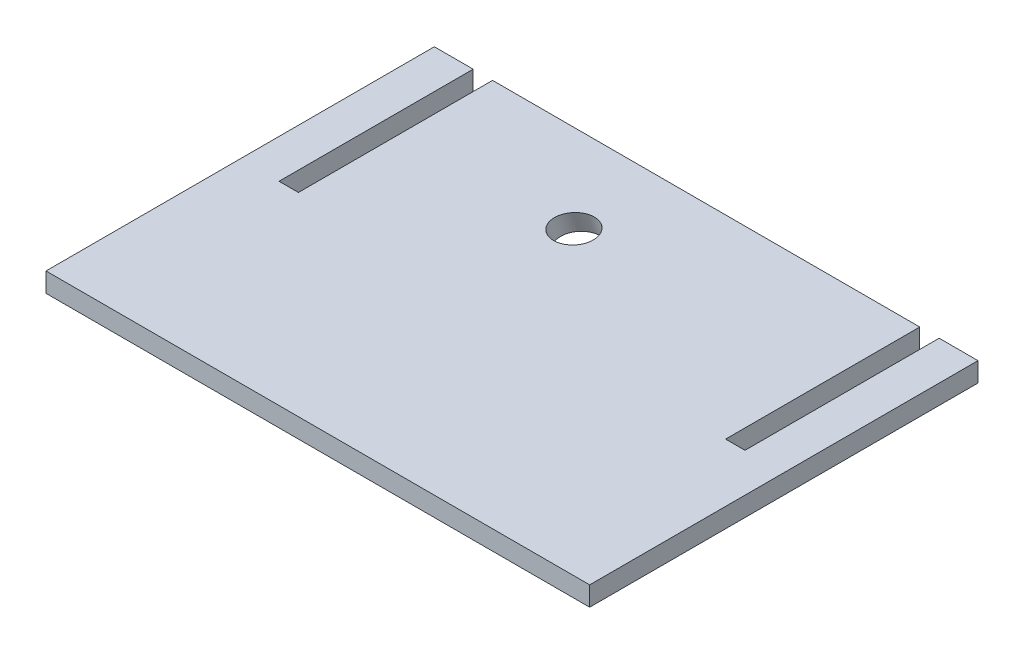
ISO-10303-21;
HEADER;
FILE_DESCRIPTION(('STEP AP214'),'2;1');
FILE_NAME('part.step','',(''),(''),'','','');
FILE_SCHEMA(('AUTOMOTIVE_DESIGN { 1 0 10303 214 1 1 1 1 }'));
ENDSEC;
DATA;
#1=APPLICATION_CONTEXT('core data for automotive mechanical design processes');
#2=APPLICATION_PROTOCOL_DEFINITION('international standard','automotive_design',2000,#1);
#3=PRODUCT_CONTEXT('',#1,'mechanical');
#4=PRODUCT('Part','Part','',(#3));
#5=PRODUCT_RELATED_PRODUCT_CATEGORY('part','',(#4));
#6=PRODUCT_DEFINITION_FORMATION('','',#4);
#7=PRODUCT_DEFINITION_CONTEXT('part definition',#1,'design');
#8=PRODUCT_DEFINITION('design','',#6,#7);
#9=PRODUCT_DEFINITION_SHAPE('','',#8);
#10=(LENGTH_UNIT() NAMED_UNIT(*) SI_UNIT(.MILLI.,.METRE.));
#11=(NAMED_UNIT(*) PLANE_ANGLE_UNIT() SI_UNIT($,.RADIAN.));
#12=(NAMED_UNIT(*) SI_UNIT($,.STERADIAN.) SOLID_ANGLE_UNIT());
#13=UNCERTAINTY_MEASURE_WITH_UNIT(LENGTH_MEASURE(1.E-05),#10,'distance_accuracy_value','');
#14=(GEOMETRIC_REPRESENTATION_CONTEXT(3) GLOBAL_UNCERTAINTY_ASSIGNED_CONTEXT((#13)) GLOBAL_UNIT_ASSIGNED_CONTEXT((#10,
#11,#12)) REPRESENTATION_CONTEXT('',''));
#15=CARTESIAN_POINT('',(0.,0.,0.));
#16=DIRECTION('',(0.,0.,1.));
#17=DIRECTION('',(1.,0.,0.));
#18=AXIS2_PLACEMENT_3D('',#15,#16,#17);
#19=CARTESIAN_POINT('',(-177.8,6.35,-127.));
#20=DIRECTION('',(0.,0.,1.));
#21=DIRECTION('',(1.,0.,0.));
#22=AXIS2_PLACEMENT_3D('',#19,#20,#21);
#23=PLANE('',#22);
#24=DIRECTION('',(-1.,0.,0.));
#25=VECTOR('',#24,1.);
#26=CARTESIAN_POINT('',(-177.8,6.35,-127.));
#27=LINE('',#26,#25);
#28=CARTESIAN_POINT('',(-152.4,6.35,-127.));
#29=VERTEX_POINT('',#28);
#30=CARTESIAN_POINT('',(-177.8,6.35,-127.));
#31=VERTEX_POINT('',#30);
#32=EDGE_CURVE('E221',#29,#31,#27,.T.);
#33=ORIENTED_EDGE('',*,*,#32,.F.);
#34=DIRECTION('',(0.,1.,0.));
#35=VECTOR('',#34,1.);
#36=CARTESIAN_POINT('',(-152.4,-6.35,-127.));
#37=LINE('',#36,#35);
#38=CARTESIAN_POINT('',(-152.4,-6.35,-127.));
#39=VERTEX_POINT('',#38);
#40=EDGE_CURVE('E199',#39,#29,#37,.T.);
#41=ORIENTED_EDGE('',*,*,#40,.F.);
#42=DIRECTION('',(-1.,0.,0.));
#43=VECTOR('',#42,1.);
#44=CARTESIAN_POINT('',(-177.8,-6.35,-127.));
#45=LINE('',#44,#43);
#46=CARTESIAN_POINT('',(-177.8,-6.35,-127.));
#47=VERTEX_POINT('',#46);
#48=EDGE_CURVE('E264',#39,#47,#45,.T.);
#49=ORIENTED_EDGE('',*,*,#48,.T.);
#50=DIRECTION('',(0.,-1.,0.));
#51=VECTOR('',#50,1.);
#52=CARTESIAN_POINT('',(-177.8,6.35,-127.));
#53=LINE('',#52,#51);
#54=EDGE_CURVE('E250',#31,#47,#53,.T.);
#55=ORIENTED_EDGE('',*,*,#54,.F.);
#56=EDGE_LOOP('',(#33,#41,#49,#55));
#57=FACE_BOUND('',#56,.T.);
#58=ADVANCED_FACE('F43',(#57),#23,.F.);
#59=CARTESIAN_POINT('',(139.7,-6.35,-127.));
#60=VERTEX_POINT('',#59);
#61=CARTESIAN_POINT('',(-139.7,-6.35,-127.));
#62=VERTEX_POINT('',#61);
#63=EDGE_CURVE('E198',#60,#62,#45,.T.);
#64=ORIENTED_EDGE('',*,*,#63,.T.);
#65=DIRECTION('',(0.,1.,0.));
#66=VECTOR('',#65,1.);
#67=CARTESIAN_POINT('',(-139.7,-6.35,-127.));
#68=LINE('',#67,#66);
#69=CARTESIAN_POINT('',(-139.7,6.35,-127.));
#70=VERTEX_POINT('',#69);
#71=EDGE_CURVE('E79',#62,#70,#68,.T.);
#72=ORIENTED_EDGE('',*,*,#71,.T.);
#73=CARTESIAN_POINT('',(139.7,6.35,-127.));
#74=VERTEX_POINT('',#73);
#75=EDGE_CURVE('E216',#74,#70,#27,.T.);
#76=ORIENTED_EDGE('',*,*,#75,.F.);
#77=DIRECTION('',(0.,1.,0.));
#78=VECTOR('',#77,1.);
#79=CARTESIAN_POINT('',(139.7,-6.35,-127.));
#80=LINE('',#79,#78);
#81=EDGE_CURVE('E174',#60,#74,#80,.T.);
#82=ORIENTED_EDGE('',*,*,#81,.F.);
#83=EDGE_LOOP('',(#64,#72,#76,#82));
#84=FACE_BOUND('',#83,.T.);
#85=ADVANCED_FACE('F302',(#84),#23,.F.);
#86=CARTESIAN_POINT('',(177.8,6.35,-127.));
#87=DIRECTION('',(-1.,0.,0.));
#88=DIRECTION('',(0.,0.,1.));
#89=AXIS2_PLACEMENT_3D('',#86,#87,#88);
#90=PLANE('',#89);
#91=DIRECTION('',(0.,0.,-1.));
#92=VECTOR('',#91,1.);
#93=CARTESIAN_POINT('',(177.8,-6.35,-127.));
#94=LINE('',#93,#92);
#95=CARTESIAN_POINT('',(177.8,-6.35,127.));
#96=VERTEX_POINT('',#95);
#97=CARTESIAN_POINT('',(177.8,-6.35,-127.));
#98=VERTEX_POINT('',#97);
#99=EDGE_CURVE('E197',#96,#98,#94,.T.);
#100=ORIENTED_EDGE('',*,*,#99,.T.);
#101=DIRECTION('',(0.,-1.,0.));
#102=VECTOR('',#101,1.);
#103=CARTESIAN_POINT('',(177.8,6.35,-127.));
#104=LINE('',#103,#102);
#105=CARTESIAN_POINT('',(177.8,6.35,-127.));
#106=VERTEX_POINT('',#105);
#107=EDGE_CURVE('E183',#106,#98,#104,.T.);
#108=ORIENTED_EDGE('',*,*,#107,.F.);
#109=DIRECTION('',(0.,0.,-1.));
#110=VECTOR('',#109,1.);
#111=CARTESIAN_POINT('',(177.8,6.35,-127.));
#112=LINE('',#111,#110);
#113=CARTESIAN_POINT('',(177.8,6.35,127.));
#114=VERTEX_POINT('',#113);
#115=EDGE_CURVE('E227',#114,#106,#112,.T.);
#116=ORIENTED_EDGE('',*,*,#115,.F.);
#117=DIRECTION('',(0.,-1.,0.));
#118=VECTOR('',#117,1.);
#119=CARTESIAN_POINT('',(177.8,6.35,127.));
#120=LINE('',#119,#118);
#121=EDGE_CURVE('E255',#114,#96,#120,.T.);
#122=ORIENTED_EDGE('',*,*,#121,.T.);
#123=EDGE_LOOP('',(#100,#108,#116,#122));
#124=FACE_BOUND('',#123,.T.);
#125=ADVANCED_FACE('F276',(#124),#90,.F.);
#126=CARTESIAN_POINT('',(152.4,-6.35,-127.));
#127=VERTEX_POINT('',#126);
#128=EDGE_CURVE('E184',#98,#127,#45,.T.);
#129=ORIENTED_EDGE('',*,*,#128,.T.);
#130=DIRECTION('',(0.,1.,0.));
#131=VECTOR('',#130,1.);
#132=CARTESIAN_POINT('',(152.4,-6.35,-127.));
#133=LINE('',#132,#131);
#134=CARTESIAN_POINT('',(152.4,6.35,-127.));
#135=VERTEX_POINT('',#134);
#136=EDGE_CURVE('E142',#127,#135,#133,.T.);
#137=ORIENTED_EDGE('',*,*,#136,.T.);
#138=EDGE_CURVE('E219',#106,#135,#27,.T.);
#139=ORIENTED_EDGE('',*,*,#138,.F.);
#140=ORIENTED_EDGE('',*,*,#107,.T.);
#141=EDGE_LOOP('',(#129,#137,#139,#140));
#142=FACE_BOUND('',#141,.T.);
#143=ADVANCED_FACE('F298',(#142),#23,.F.);
#144=CARTESIAN_POINT('',(-177.8,6.35,-127.));
#145=DIRECTION('',(1.,0.,0.));
#146=DIRECTION('',(0.,0.,-1.));
#147=AXIS2_PLACEMENT_3D('',#144,#145,#146);
#148=PLANE('',#147);
#149=DIRECTION('',(0.,0.,1.));
#150=VECTOR('',#149,1.);
#151=CARTESIAN_POINT('',(-177.8,-6.35,-127.));
#152=LINE('',#151,#150);
#153=CARTESIAN_POINT('',(-177.8,-6.35,127.));
#154=VERTEX_POINT('',#153);
#155=EDGE_CURVE('E259',#47,#154,#152,.T.);
#156=ORIENTED_EDGE('',*,*,#155,.T.);
#157=DIRECTION('',(0.,-1.,0.));
#158=VECTOR('',#157,1.);
#159=CARTESIAN_POINT('',(-177.8,6.35,127.));
#160=LINE('',#159,#158);
#161=CARTESIAN_POINT('',(-177.8,6.35,127.));
#162=VERTEX_POINT('',#161);
#163=EDGE_CURVE('E238',#162,#154,#160,.T.);
#164=ORIENTED_EDGE('',*,*,#163,.F.);
#165=DIRECTION('',(0.,0.,1.));
#166=VECTOR('',#165,1.);
#167=CARTESIAN_POINT('',(-177.8,6.35,-127.));
#168=LINE('',#167,#166);
#169=EDGE_CURVE('E230',#31,#162,#168,.T.);
#170=ORIENTED_EDGE('',*,*,#169,.F.);
#171=ORIENTED_EDGE('',*,*,#54,.T.);
#172=EDGE_LOOP('',(#156,#164,#170,#171));
#173=FACE_BOUND('',#172,.T.);
#174=ADVANCED_FACE('F290',(#173),#148,.F.);
#175=CARTESIAN_POINT('',(-177.8,6.35,127.));
#176=DIRECTION('',(0.,0.,-1.));
#177=DIRECTION('',(-1.,0.,0.));
#178=AXIS2_PLACEMENT_3D('',#175,#176,#177);
#179=PLANE('',#178);
#180=DIRECTION('',(1.,0.,0.));
#181=VECTOR('',#180,1.);
#182=CARTESIAN_POINT('',(-177.8,-6.35,127.));
#183=LINE('',#182,#181);
#184=EDGE_CURVE('E243',#154,#96,#183,.T.);
#185=ORIENTED_EDGE('',*,*,#184,.T.);
#186=ORIENTED_EDGE('',*,*,#121,.F.);
#187=DIRECTION('',(1.,0.,0.));
#188=VECTOR('',#187,1.);
#189=CARTESIAN_POINT('',(-177.8,6.35,127.));
#190=LINE('',#189,#188);
#191=EDGE_CURVE('E236',#162,#114,#190,.T.);
#192=ORIENTED_EDGE('',*,*,#191,.F.);
#193=ORIENTED_EDGE('',*,*,#163,.T.);
#194=EDGE_LOOP('',(#185,#186,#192,#193));
#195=FACE_BOUND('',#194,.T.);
#196=ADVANCED_FACE('F291',(#195),#179,.F.);
#197=CARTESIAN_POINT('',(0.,6.35,0.));
#198=DIRECTION('',(0.,1.,0.));
#199=DIRECTION('',(0.,0.,1.));
#200=AXIS2_PLACEMENT_3D('',#197,#198,#199);
#201=PLANE('',#200);
#202=CARTESIAN_POINT('',(-29.0632633217922,6.35,-69.5494140717823));
#203=DIRECTION('',(0.,1.,0.));
#204=DIRECTION('',(0.,0.,1.));
#205=AXIS2_PLACEMENT_3D('',#202,#203,#204);
#206=ELLIPSE('',#205,13.3301795384042,12.7);
#207=CARTESIAN_POINT('',(-29.0632633217924,6.35,-56.2192345333782));
#208=VERTEX_POINT('',#207);
#209=EDGE_CURVE('E47',#208,#208,#206,.F.);
#210=ORIENTED_EDGE('',*,*,#209,.T.);
#211=EDGE_LOOP('',(#210));
#212=FACE_BOUND('',#211,.T.);
#213=DIRECTION('',(0.,0.,1.));
#214=VECTOR('',#213,1.);
#215=CARTESIAN_POINT('',(-152.4,6.35,-127.));
#216=LINE('',#215,#214);
#217=CARTESIAN_POINT('',(-152.4,6.35,0.));
#218=VERTEX_POINT('',#217);
#219=EDGE_CURVE('E188',#29,#218,#216,.T.);
#220=ORIENTED_EDGE('',*,*,#219,.F.);
#221=ORIENTED_EDGE('',*,*,#32,.T.);
#222=ORIENTED_EDGE('',*,*,#169,.T.);
#223=ORIENTED_EDGE('',*,*,#191,.T.);
#224=ORIENTED_EDGE('',*,*,#115,.T.);
#225=ORIENTED_EDGE('',*,*,#138,.T.);
#226=DIRECTION('',(0.,0.,-1.));
#227=VECTOR('',#226,1.);
#228=CARTESIAN_POINT('',(152.4,6.35,-127.));
#229=LINE('',#228,#227);
#230=CARTESIAN_POINT('',(152.4,6.35,0.));
#231=VERTEX_POINT('',#230);
#232=EDGE_CURVE('E158',#231,#135,#229,.T.);
#233=ORIENTED_EDGE('',*,*,#232,.F.);
#234=DIRECTION('',(1.,0.,0.));
#235=VECTOR('',#234,1.);
#236=CARTESIAN_POINT('',(139.7,6.35,0.));
#237=LINE('',#236,#235);
#238=CARTESIAN_POINT('',(139.7,6.35,0.));
#239=VERTEX_POINT('',#238);
#240=EDGE_CURVE('E155',#239,#231,#237,.T.);
#241=ORIENTED_EDGE('',*,*,#240,.F.);
#242=DIRECTION('',(0.,0.,1.));
#243=VECTOR('',#242,1.);
#244=CARTESIAN_POINT('',(139.7,6.35,-127.));
#245=LINE('',#244,#243);
#246=EDGE_CURVE('E147',#74,#239,#245,.T.);
#247=ORIENTED_EDGE('',*,*,#246,.F.);
#248=ORIENTED_EDGE('',*,*,#75,.T.);
#249=DIRECTION('',(0.,0.,-1.));
#250=VECTOR('',#249,1.);
#251=CARTESIAN_POINT('',(-139.7,6.35,-127.));
#252=LINE('',#251,#250);
#253=CARTESIAN_POINT('',(-139.7,6.35,0.));
#254=VERTEX_POINT('',#253);
#255=EDGE_CURVE('E83',#254,#70,#252,.T.);
#256=ORIENTED_EDGE('',*,*,#255,.F.);
#257=DIRECTION('',(1.,0.,0.));
#258=VECTOR('',#257,1.);
#259=CARTESIAN_POINT('',(-152.4,6.35,0.));
#260=LINE('',#259,#258);
#261=EDGE_CURVE('E191',#218,#254,#260,.T.);
#262=ORIENTED_EDGE('',*,*,#261,.F.);
#263=EDGE_LOOP('',(#220,#221,#222,#223,#224,#225,#233,#241,#247,#248,#256,#262));
#264=FACE_BOUND('',#263,.T.);
#265=ADVANCED_FACE('F45',(#212,#264),#201,.T.);
#266=CARTESIAN_POINT('',(0.,-6.35,0.));
#267=DIRECTION('',(0.,1.,0.));
#268=DIRECTION('',(0.,0.,1.));
#269=AXIS2_PLACEMENT_3D('',#266,#267,#268);
#270=PLANE('',#269);
#271=CARTESIAN_POINT('',(-29.0632633217922,-6.35,-73.5995605538357));
#272=DIRECTION('',(0.,1.,0.));
#273=DIRECTION('',(0.,0.,1.));
#274=AXIS2_PLACEMENT_3D('',#271,#272,#273);
#275=ELLIPSE('',#274,13.3301795384042,12.7);
#276=CARTESIAN_POINT('',(-29.0632633217923,-6.35,-60.2693810154316));
#277=VERTEX_POINT('',#276);
#278=EDGE_CURVE('E11',#277,#277,#275,.F.);
#279=ORIENTED_EDGE('',*,*,#278,.F.);
#280=EDGE_LOOP('',(#279));
#281=FACE_BOUND('',#280,.T.);
#282=ORIENTED_EDGE('',*,*,#48,.F.);
#283=DIRECTION('',(0.,0.,1.));
#284=VECTOR('',#283,1.);
#285=CARTESIAN_POINT('',(-152.4,-6.35,-127.));
#286=LINE('',#285,#284);
#287=CARTESIAN_POINT('',(-152.4,-6.35,0.));
#288=VERTEX_POINT('',#287);
#289=EDGE_CURVE('E213',#39,#288,#286,.T.);
#290=ORIENTED_EDGE('',*,*,#289,.T.);
#291=DIRECTION('',(1.,0.,0.));
#292=VECTOR('',#291,1.);
#293=CARTESIAN_POINT('',(-152.4,-6.35,0.));
#294=LINE('',#293,#292);
#295=CARTESIAN_POINT('',(-139.7,-6.35,0.));
#296=VERTEX_POINT('',#295);
#297=EDGE_CURVE('E210',#288,#296,#294,.T.);
#298=ORIENTED_EDGE('',*,*,#297,.T.);
#299=DIRECTION('',(0.,0.,-1.));
#300=VECTOR('',#299,1.);
#301=CARTESIAN_POINT('',(-139.7,-6.35,-127.));
#302=LINE('',#301,#300);
#303=EDGE_CURVE('E167',#296,#62,#302,.T.);
#304=ORIENTED_EDGE('',*,*,#303,.T.);
#305=ORIENTED_EDGE('',*,*,#63,.F.);
#306=DIRECTION('',(0.,0.,1.));
#307=VECTOR('',#306,1.);
#308=CARTESIAN_POINT('',(139.7,-6.35,-127.));
#309=LINE('',#308,#307);
#310=CARTESIAN_POINT('',(139.7,-6.35,0.));
#311=VERTEX_POINT('',#310);
#312=EDGE_CURVE('E163',#60,#311,#309,.T.);
#313=ORIENTED_EDGE('',*,*,#312,.T.);
#314=DIRECTION('',(1.,0.,0.));
#315=VECTOR('',#314,1.);
#316=CARTESIAN_POINT('',(139.7,-6.35,0.));
#317=LINE('',#316,#315);
#318=CARTESIAN_POINT('',(152.4,-6.35,0.));
#319=VERTEX_POINT('',#318);
#320=EDGE_CURVE('E148',#311,#319,#317,.T.);
#321=ORIENTED_EDGE('',*,*,#320,.T.);
#322=DIRECTION('',(0.,0.,-1.));
#323=VECTOR('',#322,1.);
#324=CARTESIAN_POINT('',(152.4,-6.35,-127.));
#325=LINE('',#324,#323);
#326=EDGE_CURVE('E136',#319,#127,#325,.T.);
#327=ORIENTED_EDGE('',*,*,#326,.T.);
#328=ORIENTED_EDGE('',*,*,#128,.F.);
#329=ORIENTED_EDGE('',*,*,#99,.F.);
#330=ORIENTED_EDGE('',*,*,#184,.F.);
#331=ORIENTED_EDGE('',*,*,#155,.F.);
#332=EDGE_LOOP('',(#282,#290,#298,#304,#305,#313,#321,#327,#328,#329,#330,#331));
#333=FACE_BOUND('',#332,.T.);
#334=ADVANCED_FACE('F161',(#281,#333),#270,.F.);
#335=CARTESIAN_POINT('',(139.7,-6.35,-127.));
#336=DIRECTION('',(-1.,0.,0.));
#337=DIRECTION('',(0.,0.,1.));
#338=AXIS2_PLACEMENT_3D('',#335,#336,#337);
#339=PLANE('',#338);
#340=ORIENTED_EDGE('',*,*,#246,.T.);
#341=DIRECTION('',(0.,1.,0.));
#342=VECTOR('',#341,1.);
#343=CARTESIAN_POINT('',(139.7,-6.35,0.));
#344=LINE('',#343,#342);
#345=EDGE_CURVE('E177',#311,#239,#344,.T.);
#346=ORIENTED_EDGE('',*,*,#345,.F.);
#347=ORIENTED_EDGE('',*,*,#312,.F.);
#348=ORIENTED_EDGE('',*,*,#81,.T.);
#349=EDGE_LOOP('',(#340,#346,#347,#348));
#350=FACE_BOUND('',#349,.T.);
#351=ADVANCED_FACE('F368',(#350),#339,.F.);
#352=CARTESIAN_POINT('',(152.4,-6.35,-127.));
#353=DIRECTION('',(1.,0.,0.));
#354=DIRECTION('',(0.,0.,-1.));
#355=AXIS2_PLACEMENT_3D('',#352,#353,#354);
#356=PLANE('',#355);
#357=ORIENTED_EDGE('',*,*,#232,.T.);
#358=ORIENTED_EDGE('',*,*,#136,.F.);
#359=ORIENTED_EDGE('',*,*,#326,.F.);
#360=DIRECTION('',(0.,1.,0.));
#361=VECTOR('',#360,1.);
#362=CARTESIAN_POINT('',(152.4,-6.35,0.));
#363=LINE('',#362,#361);
#364=EDGE_CURVE('E139',#319,#231,#363,.T.);
#365=ORIENTED_EDGE('',*,*,#364,.T.);
#366=EDGE_LOOP('',(#357,#358,#359,#365));
#367=FACE_BOUND('',#366,.T.);
#368=ADVANCED_FACE('F138',(#367),#356,.F.);
#369=CARTESIAN_POINT('',(139.7,-6.35,0.));
#370=DIRECTION('',(0.,0.,1.));
#371=DIRECTION('',(1.,0.,0.));
#372=AXIS2_PLACEMENT_3D('',#369,#370,#371);
#373=PLANE('',#372);
#374=ORIENTED_EDGE('',*,*,#240,.T.);
#375=ORIENTED_EDGE('',*,*,#364,.F.);
#376=ORIENTED_EDGE('',*,*,#320,.F.);
#377=ORIENTED_EDGE('',*,*,#345,.T.);
#378=EDGE_LOOP('',(#374,#375,#376,#377));
#379=FACE_BOUND('',#378,.T.);
#380=ADVANCED_FACE('F152',(#379),#373,.F.);
#381=CARTESIAN_POINT('',(-152.4,-6.35,-127.));
#382=DIRECTION('',(-1.,0.,0.));
#383=DIRECTION('',(0.,0.,1.));
#384=AXIS2_PLACEMENT_3D('',#381,#382,#383);
#385=PLANE('',#384);
#386=ORIENTED_EDGE('',*,*,#219,.T.);
#387=DIRECTION('',(0.,1.,0.));
#388=VECTOR('',#387,1.);
#389=CARTESIAN_POINT('',(-152.4,-6.35,0.));
#390=LINE('',#389,#388);
#391=EDGE_CURVE('E54',#288,#218,#390,.T.);
#392=ORIENTED_EDGE('',*,*,#391,.F.);
#393=ORIENTED_EDGE('',*,*,#289,.F.);
#394=ORIENTED_EDGE('',*,*,#40,.T.);
#395=EDGE_LOOP('',(#386,#392,#393,#394));
#396=FACE_BOUND('',#395,.T.);
#397=ADVANCED_FACE('F396',(#396),#385,.F.);
#398=CARTESIAN_POINT('',(-139.7,-6.35,-127.));
#399=DIRECTION('',(1.,0.,0.));
#400=DIRECTION('',(0.,0.,-1.));
#401=AXIS2_PLACEMENT_3D('',#398,#399,#400);
#402=PLANE('',#401);
#403=ORIENTED_EDGE('',*,*,#255,.T.);
#404=ORIENTED_EDGE('',*,*,#71,.F.);
#405=ORIENTED_EDGE('',*,*,#303,.F.);
#406=DIRECTION('',(0.,1.,0.));
#407=VECTOR('',#406,1.);
#408=CARTESIAN_POINT('',(-139.7,-6.35,0.));
#409=LINE('',#408,#407);
#410=EDGE_CURVE('E192',#296,#254,#409,.T.);
#411=ORIENTED_EDGE('',*,*,#410,.T.);
#412=EDGE_LOOP('',(#403,#404,#405,#411));
#413=FACE_BOUND('',#412,.T.);
#414=ADVANCED_FACE('F406',(#413),#402,.F.);
#415=CARTESIAN_POINT('',(-152.4,-6.35,0.));
#416=DIRECTION('',(0.,0.,1.));
#417=DIRECTION('',(1.,0.,0.));
#418=AXIS2_PLACEMENT_3D('',#415,#416,#417);
#419=PLANE('',#418);
#420=ORIENTED_EDGE('',*,*,#261,.T.);
#421=ORIENTED_EDGE('',*,*,#410,.F.);
#422=ORIENTED_EDGE('',*,*,#297,.F.);
#423=ORIENTED_EDGE('',*,*,#391,.T.);
#424=EDGE_LOOP('',(#420,#421,#422,#423));
#425=FACE_BOUND('',#424,.T.);
#426=ADVANCED_FACE('F417',(#425),#419,.F.);
#427=CARTESIAN_POINT('',(-29.0632633217921,-44.450000000002,-85.7499999999964));
#428=DIRECTION('',(0.,0.952725352528927,0.303832853142369));
#429=DIRECTION('',(0.,0.303832853142369,-0.952725352528927));
#430=AXIS2_PLACEMENT_3D('',#427,#428,#429);
#431=CYLINDRICAL_SURFACE('',#430,12.7);
#432=ORIENTED_EDGE('',*,*,#209,.F.);
#433=EDGE_LOOP('',(#432));
#434=FACE_BOUND('',#433,.T.);
#435=ORIENTED_EDGE('',*,*,#278,.T.);
#436=EDGE_LOOP('',(#435));
#437=FACE_BOUND('',#436,.T.);
#438=ADVANCED_FACE('F427',(#434,#437),#431,.F.);
#439=CLOSED_SHELL('',(#58,#85,#125,#143,#174,#196,#265,#334,#351,#368,#380,#397,#414,#426,#438));
#440=MANIFOLD_SOLID_BREP('B2',#439);
#441=ADVANCED_BREP_SHAPE_REPRESENTATION('',(#18,#440),#14);
#442=SHAPE_DEFINITION_REPRESENTATION(#9,#441);
ENDSEC;
END-ISO-10303-21;
